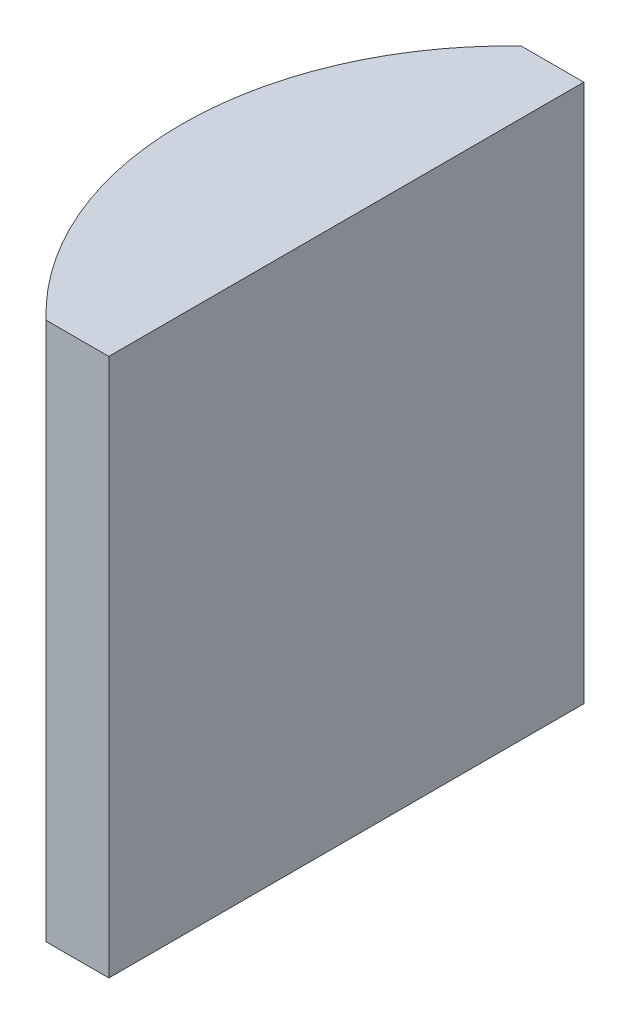
ISO-10303-21;
HEADER;
FILE_DESCRIPTION(('STEP AP214'),'2;1');
FILE_NAME('part.step','',(''),(''),'','','');
FILE_SCHEMA(('AUTOMOTIVE_DESIGN { 1 0 10303 214 1 1 1 1 }'));
ENDSEC;
DATA;
#1=APPLICATION_CONTEXT('core data for automotive mechanical design processes');
#2=APPLICATION_PROTOCOL_DEFINITION('international standard','automotive_design',2000,#1);
#3=PRODUCT_CONTEXT('',#1,'mechanical');
#4=PRODUCT('Part','Part','',(#3));
#5=PRODUCT_RELATED_PRODUCT_CATEGORY('part','',(#4));
#6=PRODUCT_DEFINITION_FORMATION('','',#4);
#7=PRODUCT_DEFINITION_CONTEXT('part definition',#1,'design');
#8=PRODUCT_DEFINITION('design','',#6,#7);
#9=PRODUCT_DEFINITION_SHAPE('','',#8);
#10=(LENGTH_UNIT() NAMED_UNIT(*) SI_UNIT(.MILLI.,.METRE.));
#11=(NAMED_UNIT(*) PLANE_ANGLE_UNIT() SI_UNIT($,.RADIAN.));
#12=(NAMED_UNIT(*) SI_UNIT($,.STERADIAN.) SOLID_ANGLE_UNIT());
#13=UNCERTAINTY_MEASURE_WITH_UNIT(LENGTH_MEASURE(1.E-05),#10,'distance_accuracy_value','');
#14=(GEOMETRIC_REPRESENTATION_CONTEXT(3) GLOBAL_UNCERTAINTY_ASSIGNED_CONTEXT((#13)) GLOBAL_UNIT_ASSIGNED_CONTEXT((#10,
#11,#12)) REPRESENTATION_CONTEXT('',''));
#15=CARTESIAN_POINT('',(0.,0.,0.));
#16=DIRECTION('',(0.,0.,1.));
#17=DIRECTION('',(1.,0.,0.));
#18=AXIS2_PLACEMENT_3D('',#15,#16,#17);
#19=CARTESIAN_POINT('',(4.35520433485127,17.,0.));
#20=DIRECTION('',(0.,-1.,0.));
#21=DIRECTION('',(0.,0.,-1.));
#22=AXIS2_PLACEMENT_3D('',#19,#20,#21);
#23=CYLINDRICAL_SURFACE('',#22,10.34);
#24=CARTESIAN_POINT('',(4.35520433485127,0.,0.));
#25=DIRECTION('',(0.,1.,0.));
#26=DIRECTION('',(0.,0.,1.));
#27=AXIS2_PLACEMENT_3D('',#24,#25,#26);
#28=CIRCLE('',#27,10.34);
#29=CARTESIAN_POINT('',(-2.76277290591033,0.,-7.5));
#30=VERTEX_POINT('',#29);
#31=CARTESIAN_POINT('',(-2.76277290591033,0.,7.5));
#32=VERTEX_POINT('',#31);
#33=EDGE_CURVE('E100',#30,#32,#28,.T.);
#34=ORIENTED_EDGE('',*,*,#33,.T.);
#35=DIRECTION('',(0.,-1.,0.));
#36=VECTOR('',#35,1.);
#37=CARTESIAN_POINT('',(-2.76277290591033,17.,7.5));
#38=LINE('',#37,#36);
#39=CARTESIAN_POINT('',(-2.76277290591033,17.,7.5));
#40=VERTEX_POINT('',#39);
#41=EDGE_CURVE('E11',#40,#32,#38,.T.);
#42=ORIENTED_EDGE('',*,*,#41,.F.);
#43=CARTESIAN_POINT('',(4.35520433485127,17.,0.));
#44=DIRECTION('',(0.,1.,0.));
#45=DIRECTION('',(0.,0.,1.));
#46=AXIS2_PLACEMENT_3D('',#43,#44,#45);
#47=CIRCLE('',#46,10.34);
#48=CARTESIAN_POINT('',(-2.76277290591033,17.,-7.5));
#49=VERTEX_POINT('',#48);
#50=EDGE_CURVE('E88',#49,#40,#47,.T.);
#51=ORIENTED_EDGE('',*,*,#50,.F.);
#52=DIRECTION('',(0.,-1.,0.));
#53=VECTOR('',#52,1.);
#54=CARTESIAN_POINT('',(-2.76277290591033,17.,-7.5));
#55=LINE('',#54,#53);
#56=EDGE_CURVE('E96',#49,#30,#55,.T.);
#57=ORIENTED_EDGE('',*,*,#56,.T.);
#58=EDGE_LOOP('',(#34,#42,#51,#57));
#59=FACE_BOUND('',#58,.T.);
#60=ADVANCED_FACE('F37',(#59),#23,.T.);
#61=CARTESIAN_POINT('',(-2.76277290591033,17.,7.5));
#62=DIRECTION('',(0.,0.,-1.));
#63=DIRECTION('',(-1.,0.,0.));
#64=AXIS2_PLACEMENT_3D('',#61,#62,#63);
#65=PLANE('',#64);
#66=DIRECTION('',(1.,0.,0.));
#67=VECTOR('',#66,1.);
#68=CARTESIAN_POINT('',(-2.76277290591033,0.,7.5));
#69=LINE('',#68,#67);
#70=CARTESIAN_POINT('',(-0.784795665148736,0.,7.5));
#71=VERTEX_POINT('',#70);
#72=EDGE_CURVE('E92',#32,#71,#69,.T.);
#73=ORIENTED_EDGE('',*,*,#72,.T.);
#74=DIRECTION('',(0.,-1.,0.));
#75=VECTOR('',#74,1.);
#76=CARTESIAN_POINT('',(-0.784795665148736,17.,7.5));
#77=LINE('',#76,#75);
#78=CARTESIAN_POINT('',(-0.784795665148736,17.,7.5));
#79=VERTEX_POINT('',#78);
#80=EDGE_CURVE('E45',#79,#71,#77,.T.);
#81=ORIENTED_EDGE('',*,*,#80,.F.);
#82=DIRECTION('',(1.,0.,0.));
#83=VECTOR('',#82,1.);
#84=CARTESIAN_POINT('',(-2.76277290591033,17.,7.5));
#85=LINE('',#84,#83);
#86=EDGE_CURVE('E83',#40,#79,#85,.T.);
#87=ORIENTED_EDGE('',*,*,#86,.F.);
#88=ORIENTED_EDGE('',*,*,#41,.T.);
#89=EDGE_LOOP('',(#73,#81,#87,#88));
#90=FACE_BOUND('',#89,.T.);
#91=ADVANCED_FACE('F91',(#90),#65,.F.);
#92=CARTESIAN_POINT('',(-0.784795665148741,17.,-7.50000000000001));
#93=DIRECTION('',(-1.,0.,0.));
#94=DIRECTION('',(0.,0.,1.));
#95=AXIS2_PLACEMENT_3D('',#92,#93,#94);
#96=PLANE('',#95);
#97=DIRECTION('',(0.,0.,-1.));
#98=VECTOR('',#97,1.);
#99=CARTESIAN_POINT('',(-0.784795665148741,0.,-7.50000000000001));
#100=LINE('',#99,#98);
#101=CARTESIAN_POINT('',(-0.784795665148741,0.,-7.50000000000001));
#102=VERTEX_POINT('',#101);
#103=EDGE_CURVE('E70',#71,#102,#100,.T.);
#104=ORIENTED_EDGE('',*,*,#103,.T.);
#105=DIRECTION('',(0.,-1.,0.));
#106=VECTOR('',#105,1.);
#107=CARTESIAN_POINT('',(-0.784795665148741,17.,-7.50000000000001));
#108=LINE('',#107,#106);
#109=CARTESIAN_POINT('',(-0.784795665148741,17.,-7.50000000000001));
#110=VERTEX_POINT('',#109);
#111=EDGE_CURVE('E93',#110,#102,#108,.T.);
#112=ORIENTED_EDGE('',*,*,#111,.F.);
#113=DIRECTION('',(0.,0.,-1.));
#114=VECTOR('',#113,1.);
#115=CARTESIAN_POINT('',(-0.784795665148741,17.,-7.50000000000001));
#116=LINE('',#115,#114);
#117=EDGE_CURVE('E86',#79,#110,#116,.T.);
#118=ORIENTED_EDGE('',*,*,#117,.F.);
#119=ORIENTED_EDGE('',*,*,#80,.T.);
#120=EDGE_LOOP('',(#104,#112,#118,#119));
#121=FACE_BOUND('',#120,.T.);
#122=ADVANCED_FACE('F94',(#121),#96,.F.);
#123=CARTESIAN_POINT('',(-2.76277290591033,17.,-7.5));
#124=DIRECTION('',(0.,0.,1.));
#125=DIRECTION('',(1.,0.,0.));
#126=AXIS2_PLACEMENT_3D('',#123,#124,#125);
#127=PLANE('',#126);
#128=DIRECTION('',(-1.,0.,0.));
#129=VECTOR('',#128,1.);
#130=CARTESIAN_POINT('',(-2.76277290591033,0.,-7.5));
#131=LINE('',#130,#129);
#132=EDGE_CURVE('E76',#102,#30,#131,.T.);
#133=ORIENTED_EDGE('',*,*,#132,.T.);
#134=ORIENTED_EDGE('',*,*,#56,.F.);
#135=DIRECTION('',(-1.,0.,0.));
#136=VECTOR('',#135,1.);
#137=CARTESIAN_POINT('',(-2.76277290591033,17.,-7.5));
#138=LINE('',#137,#136);
#139=EDGE_CURVE('E53',#110,#49,#138,.T.);
#140=ORIENTED_EDGE('',*,*,#139,.F.);
#141=ORIENTED_EDGE('',*,*,#111,.T.);
#142=EDGE_LOOP('',(#133,#134,#140,#141));
#143=FACE_BOUND('',#142,.T.);
#144=ADVANCED_FACE('F107',(#143),#127,.F.);
#145=CARTESIAN_POINT('',(4.35520433485127,17.,0.));
#146=DIRECTION('',(0.,1.,0.));
#147=DIRECTION('',(0.,0.,1.));
#148=AXIS2_PLACEMENT_3D('',#145,#146,#147);
#149=PLANE('',#148);
#150=ORIENTED_EDGE('',*,*,#50,.T.);
#151=ORIENTED_EDGE('',*,*,#86,.T.);
#152=ORIENTED_EDGE('',*,*,#117,.T.);
#153=ORIENTED_EDGE('',*,*,#139,.T.);
#154=EDGE_LOOP('',(#150,#151,#152,#153));
#155=FACE_BOUND('',#154,.T.);
#156=ADVANCED_FACE('F84',(#155),#149,.T.);
#157=CARTESIAN_POINT('',(4.35520433485127,0.,0.));
#158=DIRECTION('',(0.,1.,0.));
#159=DIRECTION('',(0.,0.,1.));
#160=AXIS2_PLACEMENT_3D('',#157,#158,#159);
#161=PLANE('',#160);
#162=ORIENTED_EDGE('',*,*,#33,.F.);
#163=ORIENTED_EDGE('',*,*,#132,.F.);
#164=ORIENTED_EDGE('',*,*,#103,.F.);
#165=ORIENTED_EDGE('',*,*,#72,.F.);
#166=EDGE_LOOP('',(#162,#163,#164,#165));
#167=FACE_BOUND('',#166,.T.);
#168=ADVANCED_FACE('F110',(#167),#161,.F.);
#169=CLOSED_SHELL('',(#60,#91,#122,#144,#156,#168));
#170=MANIFOLD_SOLID_BREP('B2',#169);
#171=ADVANCED_BREP_SHAPE_REPRESENTATION('',(#18,#170),#14);
#172=SHAPE_DEFINITION_REPRESENTATION(#9,#171);
ENDSEC;
END-ISO-10303-21;
